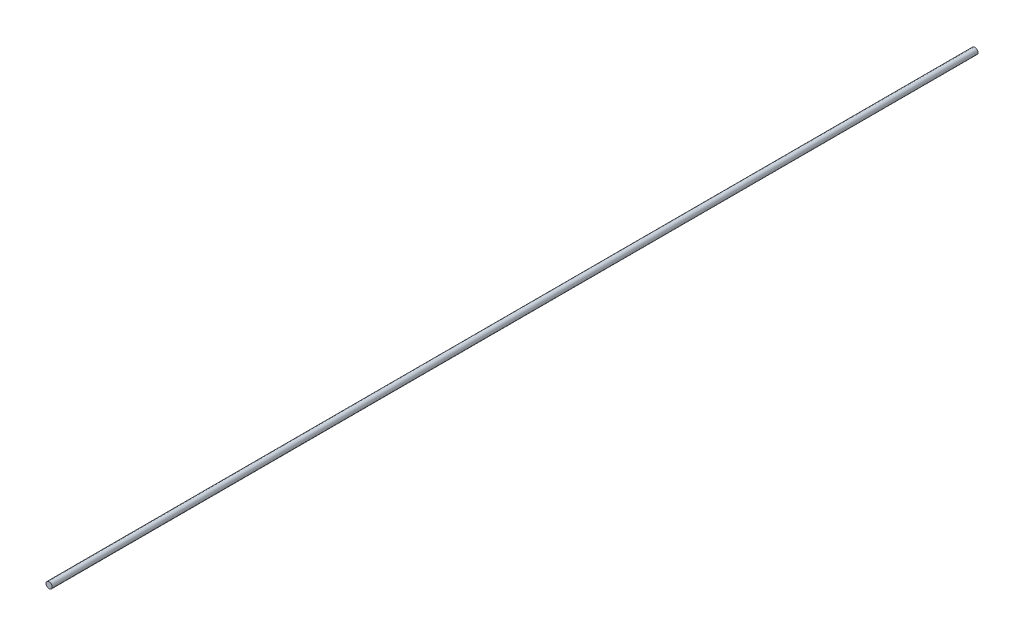
ISO-10303-21;
HEADER;
FILE_DESCRIPTION(('STEP AP214'),'2;1');
FILE_NAME('part.step','',(''),(''),'','','');
FILE_SCHEMA(('AUTOMOTIVE_DESIGN { 1 0 10303 214 1 1 1 1 }'));
ENDSEC;
DATA;
#1=APPLICATION_CONTEXT('core data for automotive mechanical design processes');
#2=APPLICATION_PROTOCOL_DEFINITION('international standard','automotive_design',2000,#1);
#3=PRODUCT_CONTEXT('',#1,'mechanical');
#4=PRODUCT('Part','Part','',(#3));
#5=PRODUCT_RELATED_PRODUCT_CATEGORY('part','',(#4));
#6=PRODUCT_DEFINITION_FORMATION('','',#4);
#7=PRODUCT_DEFINITION_CONTEXT('part definition',#1,'design');
#8=PRODUCT_DEFINITION('design','',#6,#7);
#9=PRODUCT_DEFINITION_SHAPE('','',#8);
#10=(LENGTH_UNIT() NAMED_UNIT(*) SI_UNIT(.MILLI.,.METRE.));
#11=(NAMED_UNIT(*) PLANE_ANGLE_UNIT() SI_UNIT($,.RADIAN.));
#12=(NAMED_UNIT(*) SI_UNIT($,.STERADIAN.) SOLID_ANGLE_UNIT());
#13=UNCERTAINTY_MEASURE_WITH_UNIT(LENGTH_MEASURE(1.E-05),#10,'distance_accuracy_value','');
#14=(GEOMETRIC_REPRESENTATION_CONTEXT(3) GLOBAL_UNCERTAINTY_ASSIGNED_CONTEXT((#13)) GLOBAL_UNIT_ASSIGNED_CONTEXT((#10,
#11,#12)) REPRESENTATION_CONTEXT('',''));
#15=CARTESIAN_POINT('',(0.,0.,0.));
#16=DIRECTION('',(0.,0.,1.));
#17=DIRECTION('',(1.,0.,0.));
#18=AXIS2_PLACEMENT_3D('',#15,#16,#17);
#19=CARTESIAN_POINT('',(0.,0.,900.));
#20=DIRECTION('',(0.,0.,-1.));
#21=DIRECTION('',(-1.,0.,0.));
#22=AXIS2_PLACEMENT_3D('',#19,#20,#21);
#23=CYLINDRICAL_SURFACE('',#22,6.);
#24=CARTESIAN_POINT('',(0.,0.,900.));
#25=DIRECTION('',(0.,0.,1.));
#26=DIRECTION('',(1.,0.,0.));
#27=AXIS2_PLACEMENT_3D('',#24,#25,#26);
#28=CIRCLE('',#27,6.);
#29=CARTESIAN_POINT('',(6.,0.,900.));
#30=VERTEX_POINT('',#29);
#31=EDGE_CURVE('E10',#30,#30,#28,.T.);
#32=ORIENTED_EDGE('',*,*,#31,.F.);
#33=EDGE_LOOP('',(#32));
#34=FACE_BOUND('',#33,.T.);
#35=CARTESIAN_POINT('',(0.,0.,-900.));
#36=DIRECTION('',(0.,0.,1.));
#37=DIRECTION('',(1.,0.,0.));
#38=AXIS2_PLACEMENT_3D('',#35,#36,#37);
#39=CIRCLE('',#38,6.);
#40=CARTESIAN_POINT('',(6.,0.,-900.));
#41=VERTEX_POINT('',#40);
#42=EDGE_CURVE('E39',#41,#41,#39,.T.);
#43=ORIENTED_EDGE('',*,*,#42,.T.);
#44=EDGE_LOOP('',(#43));
#45=FACE_BOUND('',#44,.T.);
#46=ADVANCED_FACE('F36',(#34,#45),#23,.T.);
#47=CARTESIAN_POINT('',(0.,0.,900.));
#48=DIRECTION('',(0.,0.,1.));
#49=DIRECTION('',(1.,0.,0.));
#50=AXIS2_PLACEMENT_3D('',#47,#48,#49);
#51=PLANE('',#50);
#52=ORIENTED_EDGE('',*,*,#31,.T.);
#53=EDGE_LOOP('',(#52));
#54=FACE_BOUND('',#53,.T.);
#55=ADVANCED_FACE('F51',(#54),#51,.T.);
#56=CARTESIAN_POINT('',(0.,0.,-900.));
#57=DIRECTION('',(0.,0.,1.));
#58=DIRECTION('',(1.,0.,0.));
#59=AXIS2_PLACEMENT_3D('',#56,#57,#58);
#60=PLANE('',#59);
#61=ORIENTED_EDGE('',*,*,#42,.F.);
#62=EDGE_LOOP('',(#61));
#63=FACE_BOUND('',#62,.T.);
#64=ADVANCED_FACE('F49',(#63),#60,.F.);
#65=CLOSED_SHELL('',(#46,#55,#64));
#66=MANIFOLD_SOLID_BREP('B2',#65);
#67=ADVANCED_BREP_SHAPE_REPRESENTATION('',(#18,#66),#14);
#68=SHAPE_DEFINITION_REPRESENTATION(#9,#67);
ENDSEC;
END-ISO-10303-21;
